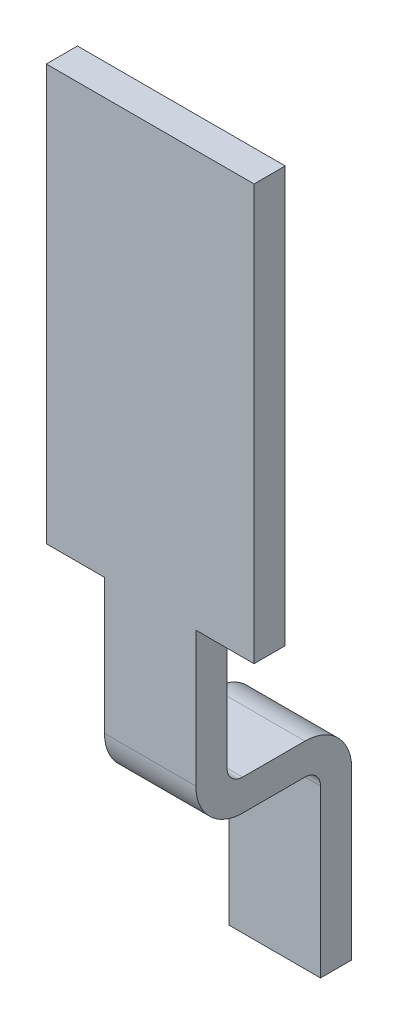
ISO-10303-21;
HEADER;
FILE_DESCRIPTION(('STEP AP214'),'2;1');
FILE_NAME('part.step','',(''),(''),'','','');
FILE_SCHEMA(('AUTOMOTIVE_DESIGN { 1 0 10303 214 1 1 1 1 }'));
ENDSEC;
DATA;
#1=APPLICATION_CONTEXT('core data for automotive mechanical design processes');
#2=APPLICATION_PROTOCOL_DEFINITION('international standard','automotive_design',2000,#1);
#3=PRODUCT_CONTEXT('',#1,'mechanical');
#4=PRODUCT('Part','Part','',(#3));
#5=PRODUCT_RELATED_PRODUCT_CATEGORY('part','',(#4));
#6=PRODUCT_DEFINITION_FORMATION('','',#4);
#7=PRODUCT_DEFINITION_CONTEXT('part definition',#1,'design');
#8=PRODUCT_DEFINITION('design','',#6,#7);
#9=PRODUCT_DEFINITION_SHAPE('','',#8);
#10=(LENGTH_UNIT() NAMED_UNIT(*) SI_UNIT(.MILLI.,.METRE.));
#11=(NAMED_UNIT(*) PLANE_ANGLE_UNIT() SI_UNIT($,.RADIAN.));
#12=(NAMED_UNIT(*) SI_UNIT($,.STERADIAN.) SOLID_ANGLE_UNIT());
#13=UNCERTAINTY_MEASURE_WITH_UNIT(LENGTH_MEASURE(1.E-05),#10,'distance_accuracy_value','');
#14=(GEOMETRIC_REPRESENTATION_CONTEXT(3) GLOBAL_UNCERTAINTY_ASSIGNED_CONTEXT((#13)) GLOBAL_UNIT_ASSIGNED_CONTEXT((#10,
#11,#12)) REPRESENTATION_CONTEXT('',''));
#15=CARTESIAN_POINT('',(0.,0.,0.));
#16=DIRECTION('',(0.,0.,1.));
#17=DIRECTION('',(1.,0.,0.));
#18=AXIS2_PLACEMENT_3D('',#15,#16,#17);
#19=CARTESIAN_POINT('',(0.,-2.9,-0.075));
#20=DIRECTION('',(1.,0.,0.));
#21=DIRECTION('',(0.,1.,0.));
#22=AXIS2_PLACEMENT_3D('',#19,#20,#21);
#23=CYLINDRICAL_SURFACE('',#22,0.075);
#24=CARTESIAN_POINT('',(0.22,-2.9,-0.075));
#25=DIRECTION('',(1.,0.,0.));
#26=DIRECTION('',(0.,1.,0.));
#27=AXIS2_PLACEMENT_3D('',#24,#25,#26);
#28=CIRCLE('',#27,0.075);
#29=CARTESIAN_POINT('',(0.22,-2.9,0.));
#30=VERTEX_POINT('',#29);
#31=CARTESIAN_POINT('',(0.22,-2.975,-0.075));
#32=VERTEX_POINT('',#31);
#33=EDGE_CURVE('E217',#30,#32,#28,.T.);
#34=ORIENTED_EDGE('',*,*,#33,.T.);
#35=DIRECTION('',(1.,0.,0.));
#36=VECTOR('',#35,1.);
#37=CARTESIAN_POINT('',(-0.22,-2.975,-0.075));
#38=LINE('',#37,#36);
#39=CARTESIAN_POINT('',(-0.22,-2.975,-0.075));
#40=VERTEX_POINT('',#39);
#41=EDGE_CURVE('E238',#40,#32,#38,.T.);
#42=ORIENTED_EDGE('',*,*,#41,.F.);
#43=CARTESIAN_POINT('',(-0.22,-2.9,-0.075));
#44=DIRECTION('',(1.,0.,0.));
#45=DIRECTION('',(0.,1.,0.));
#46=AXIS2_PLACEMENT_3D('',#43,#44,#45);
#47=CIRCLE('',#46,0.075);
#48=CARTESIAN_POINT('',(-0.22,-2.9,0.));
#49=VERTEX_POINT('',#48);
#50=EDGE_CURVE('E264',#40,#49,#47,.F.);
#51=ORIENTED_EDGE('',*,*,#50,.T.);
#52=DIRECTION('',(1.,0.,0.));
#53=VECTOR('',#52,1.);
#54=CARTESIAN_POINT('',(-0.5,-2.9,0.));
#55=LINE('',#54,#53);
#56=EDGE_CURVE('E212',#49,#30,#55,.T.);
#57=ORIENTED_EDGE('',*,*,#56,.T.);
#58=EDGE_LOOP('',(#34,#42,#51,#57));
#59=FACE_BOUND('',#58,.T.);
#60=ADVANCED_FACE('F17',(#59),#23,.F.);
#61=CARTESIAN_POINT('',(-0.22,-2.975,-0.375));
#62=DIRECTION('',(0.,1.,0.));
#63=DIRECTION('',(0.,0.,1.));
#64=AXIS2_PLACEMENT_3D('',#61,#62,#63);
#65=PLANE('',#64);
#66=DIRECTION('',(-1.,0.,0.));
#67=VECTOR('',#66,1.);
#68=CARTESIAN_POINT('',(0.,-2.975,-0.375));
#69=LINE('',#68,#67);
#70=CARTESIAN_POINT('',(-0.22,-2.975,-0.375));
#71=VERTEX_POINT('',#70);
#72=CARTESIAN_POINT('',(0.22,-2.975,-0.375));
#73=VERTEX_POINT('',#72);
#74=EDGE_CURVE('E235',#71,#73,#69,.F.);
#75=ORIENTED_EDGE('',*,*,#74,.F.);
#76=DIRECTION('',(0.,0.,-1.));
#77=VECTOR('',#76,1.);
#78=CARTESIAN_POINT('',(-0.22,-2.975,0.15));
#79=LINE('',#78,#77);
#80=EDGE_CURVE('E265',#71,#40,#79,.F.);
#81=ORIENTED_EDGE('',*,*,#80,.T.);
#82=ORIENTED_EDGE('',*,*,#41,.T.);
#83=DIRECTION('',(0.,0.,1.));
#84=VECTOR('',#83,1.);
#85=CARTESIAN_POINT('',(0.22,-2.975,0.15));
#86=LINE('',#85,#84);
#87=EDGE_CURVE('E259',#32,#73,#86,.F.);
#88=ORIENTED_EDGE('',*,*,#87,.T.);
#89=EDGE_LOOP('',(#75,#81,#82,#88));
#90=FACE_BOUND('',#89,.T.);
#91=ADVANCED_FACE('F351',(#90),#65,.T.);
#92=CARTESIAN_POINT('',(0.,-3.2,-0.375));
#93=DIRECTION('',(-1.,0.,0.));
#94=DIRECTION('',(0.,-1.,0.));
#95=AXIS2_PLACEMENT_3D('',#92,#93,#94);
#96=CYLINDRICAL_SURFACE('',#95,0.225);
#97=DIRECTION('',(1.,0.,0.));
#98=VECTOR('',#97,1.);
#99=CARTESIAN_POINT('',(-0.22,-3.2,-0.6));
#100=LINE('',#99,#98);
#101=CARTESIAN_POINT('',(-0.22,-3.2,-0.6));
#102=VERTEX_POINT('',#101);
#103=CARTESIAN_POINT('',(0.22,-3.2,-0.6));
#104=VERTEX_POINT('',#103);
#105=EDGE_CURVE('E230',#102,#104,#100,.T.);
#106=ORIENTED_EDGE('',*,*,#105,.F.);
#107=CARTESIAN_POINT('',(-0.22,-3.2,-0.375));
#108=DIRECTION('',(-1.,0.,0.));
#109=DIRECTION('',(0.,-1.,0.));
#110=AXIS2_PLACEMENT_3D('',#107,#108,#109);
#111=CIRCLE('',#110,0.225);
#112=EDGE_CURVE('E266',#102,#71,#111,.F.);
#113=ORIENTED_EDGE('',*,*,#112,.T.);
#114=ORIENTED_EDGE('',*,*,#74,.T.);
#115=CARTESIAN_POINT('',(0.22,-3.2,-0.375));
#116=DIRECTION('',(-1.,0.,0.));
#117=DIRECTION('',(0.,-1.,0.));
#118=AXIS2_PLACEMENT_3D('',#115,#116,#117);
#119=CIRCLE('',#118,0.225);
#120=EDGE_CURVE('E257',#73,#104,#119,.T.);
#121=ORIENTED_EDGE('',*,*,#120,.T.);
#122=EDGE_LOOP('',(#106,#113,#114,#121));
#123=FACE_BOUND('',#122,.T.);
#124=ADVANCED_FACE('F353',(#123),#96,.T.);
#125=CARTESIAN_POINT('',(-0.22,-4.,-0.6));
#126=DIRECTION('',(0.,0.,-1.));
#127=DIRECTION('',(0.,1.,0.));
#128=AXIS2_PLACEMENT_3D('',#125,#126,#127);
#129=PLANE('',#128);
#130=DIRECTION('',(1.,0.,0.));
#131=VECTOR('',#130,1.);
#132=CARTESIAN_POINT('',(0.,-4.,-0.6));
#133=LINE('',#132,#131);
#134=CARTESIAN_POINT('',(0.22,-4.,-0.6));
#135=VERTEX_POINT('',#134);
#136=CARTESIAN_POINT('',(-0.22,-4.,-0.6));
#137=VERTEX_POINT('',#136);
#138=EDGE_CURVE('E221',#135,#137,#133,.F.);
#139=ORIENTED_EDGE('',*,*,#138,.T.);
#140=DIRECTION('',(0.,1.,0.));
#141=VECTOR('',#140,1.);
#142=CARTESIAN_POINT('',(-0.22,-2.25,-0.6));
#143=LINE('',#142,#141);
#144=EDGE_CURVE('E155',#137,#102,#143,.T.);
#145=ORIENTED_EDGE('',*,*,#144,.T.);
#146=ORIENTED_EDGE('',*,*,#105,.T.);
#147=DIRECTION('',(0.,1.,0.));
#148=VECTOR('',#147,1.);
#149=CARTESIAN_POINT('',(0.22,-2.75,-0.6));
#150=LINE('',#149,#148);
#151=EDGE_CURVE('E226',#104,#135,#150,.F.);
#152=ORIENTED_EDGE('',*,*,#151,.T.);
#153=EDGE_LOOP('',(#139,#145,#146,#152));
#154=FACE_BOUND('',#153,.T.);
#155=ADVANCED_FACE('F357',(#154),#129,.T.);
#156=CARTESIAN_POINT('',(0.,-4.,-0.525));
#157=DIRECTION('',(0.,1.,0.));
#158=DIRECTION('',(0.,0.,1.));
#159=AXIS2_PLACEMENT_3D('',#156,#157,#158);
#160=PLANE('',#159);
#161=DIRECTION('',(0.,0.,1.));
#162=VECTOR('',#161,1.);
#163=CARTESIAN_POINT('',(0.22,-4.,0.15));
#164=LINE('',#163,#162);
#165=CARTESIAN_POINT('',(0.22,-4.,-0.45));
#166=VERTEX_POINT('',#165);
#167=EDGE_CURVE('E224',#135,#166,#164,.T.);
#168=ORIENTED_EDGE('',*,*,#167,.T.);
#169=DIRECTION('',(1.,0.,0.));
#170=VECTOR('',#169,1.);
#171=CARTESIAN_POINT('',(0.22,-4.,-0.45));
#172=LINE('',#171,#170);
#173=CARTESIAN_POINT('',(-0.22,-4.,-0.45));
#174=VERTEX_POINT('',#173);
#175=EDGE_CURVE('E143',#174,#166,#172,.T.);
#176=ORIENTED_EDGE('',*,*,#175,.F.);
#177=DIRECTION('',(0.,0.,-1.));
#178=VECTOR('',#177,1.);
#179=CARTESIAN_POINT('',(-0.22,-4.,0.15));
#180=LINE('',#179,#178);
#181=EDGE_CURVE('E153',#174,#137,#180,.T.);
#182=ORIENTED_EDGE('',*,*,#181,.T.);
#183=ORIENTED_EDGE('',*,*,#138,.F.);
#184=EDGE_LOOP('',(#168,#176,#182,#183));
#185=FACE_BOUND('',#184,.T.);
#186=ADVANCED_FACE('F359',(#185),#160,.F.);
#187=CARTESIAN_POINT('',(0.22,-4.,-0.45));
#188=DIRECTION('',(0.,0.,1.));
#189=DIRECTION('',(0.,-1.,0.));
#190=AXIS2_PLACEMENT_3D('',#187,#188,#189);
#191=PLANE('',#190);
#192=DIRECTION('',(0.,1.,0.));
#193=VECTOR('',#192,1.);
#194=CARTESIAN_POINT('',(-0.22,-2.25,-0.45));
#195=LINE('',#194,#193);
#196=CARTESIAN_POINT('',(-0.22,-3.2,-0.45));
#197=VERTEX_POINT('',#196);
#198=EDGE_CURVE('E138',#197,#174,#195,.F.);
#199=ORIENTED_EDGE('',*,*,#198,.T.);
#200=ORIENTED_EDGE('',*,*,#175,.T.);
#201=DIRECTION('',(0.,1.,0.));
#202=VECTOR('',#201,1.);
#203=CARTESIAN_POINT('',(0.22,-2.75,-0.45));
#204=LINE('',#203,#202);
#205=CARTESIAN_POINT('',(0.22,-3.2,-0.45));
#206=VERTEX_POINT('',#205);
#207=EDGE_CURVE('E141',#166,#206,#204,.T.);
#208=ORIENTED_EDGE('',*,*,#207,.T.);
#209=DIRECTION('',(-1.,0.,0.));
#210=VECTOR('',#209,1.);
#211=CARTESIAN_POINT('',(0.,-3.2,-0.45));
#212=LINE('',#211,#210);
#213=EDGE_CURVE('E134',#206,#197,#212,.T.);
#214=ORIENTED_EDGE('',*,*,#213,.T.);
#215=EDGE_LOOP('',(#199,#200,#208,#214));
#216=FACE_BOUND('',#215,.T.);
#217=ADVANCED_FACE('F135',(#216),#191,.T.);
#218=CARTESIAN_POINT('',(0.,-3.2,-0.375));
#219=DIRECTION('',(-1.,0.,0.));
#220=DIRECTION('',(0.,-1.,0.));
#221=AXIS2_PLACEMENT_3D('',#218,#219,#220);
#222=CYLINDRICAL_SURFACE('',#221,0.075);
#223=DIRECTION('',(1.,0.,0.));
#224=VECTOR('',#223,1.);
#225=CARTESIAN_POINT('',(0.22,-3.125,-0.375));
#226=LINE('',#225,#224);
#227=CARTESIAN_POINT('',(-0.22,-3.125,-0.375));
#228=VERTEX_POINT('',#227);
#229=CARTESIAN_POINT('',(0.22,-3.125,-0.375));
#230=VERTEX_POINT('',#229);
#231=EDGE_CURVE('E128',#228,#230,#226,.T.);
#232=ORIENTED_EDGE('',*,*,#231,.F.);
#233=CARTESIAN_POINT('',(-0.22,-3.2,-0.375));
#234=DIRECTION('',(-1.,0.,0.));
#235=DIRECTION('',(0.,-1.,0.));
#236=AXIS2_PLACEMENT_3D('',#233,#234,#235);
#237=CIRCLE('',#236,0.075);
#238=EDGE_CURVE('E20',#228,#197,#237,.T.);
#239=ORIENTED_EDGE('',*,*,#238,.T.);
#240=ORIENTED_EDGE('',*,*,#213,.F.);
#241=CARTESIAN_POINT('',(0.22,-3.2,-0.375));
#242=DIRECTION('',(-1.,0.,0.));
#243=DIRECTION('',(0.,-1.,0.));
#244=AXIS2_PLACEMENT_3D('',#241,#242,#243);
#245=CIRCLE('',#244,0.075);
#246=EDGE_CURVE('E255',#206,#230,#245,.F.);
#247=ORIENTED_EDGE('',*,*,#246,.T.);
#248=EDGE_LOOP('',(#232,#239,#240,#247));
#249=FACE_BOUND('',#248,.T.);
#250=ADVANCED_FACE('F146',(#249),#222,.F.);
#251=CARTESIAN_POINT('',(0.22,-3.125,-0.375));
#252=DIRECTION('',(0.,-1.,0.));
#253=DIRECTION('',(0.,0.,-1.));
#254=AXIS2_PLACEMENT_3D('',#251,#252,#253);
#255=PLANE('',#254);
#256=DIRECTION('',(0.,0.,-1.));
#257=VECTOR('',#256,1.);
#258=CARTESIAN_POINT('',(-0.22,-3.125,0.15));
#259=LINE('',#258,#257);
#260=CARTESIAN_POINT('',(-0.22,-3.125,-0.075));
#261=VERTEX_POINT('',#260);
#262=EDGE_CURVE('E148',#261,#228,#259,.T.);
#263=ORIENTED_EDGE('',*,*,#262,.T.);
#264=ORIENTED_EDGE('',*,*,#231,.T.);
#265=DIRECTION('',(0.,0.,1.));
#266=VECTOR('',#265,1.);
#267=CARTESIAN_POINT('',(0.22,-3.125,0.15));
#268=LINE('',#267,#266);
#269=CARTESIAN_POINT('',(0.22,-3.125,-0.075));
#270=VERTEX_POINT('',#269);
#271=EDGE_CURVE('E254',#230,#270,#268,.T.);
#272=ORIENTED_EDGE('',*,*,#271,.T.);
#273=DIRECTION('',(1.,0.,0.));
#274=VECTOR('',#273,1.);
#275=CARTESIAN_POINT('',(0.,-3.125,-0.075));
#276=LINE('',#275,#274);
#277=EDGE_CURVE('E214',#261,#270,#276,.T.);
#278=ORIENTED_EDGE('',*,*,#277,.F.);
#279=EDGE_LOOP('',(#263,#264,#272,#278));
#280=FACE_BOUND('',#279,.T.);
#281=ADVANCED_FACE('F361',(#280),#255,.T.);
#282=CARTESIAN_POINT('',(-0.5,-2.25,0.));
#283=DIRECTION('',(0.,0.,1.));
#284=DIRECTION('',(1.,0.,0.));
#285=AXIS2_PLACEMENT_3D('',#282,#283,#284);
#286=PLANE('',#285);
#287=DIRECTION('',(1.,0.,0.));
#288=VECTOR('',#287,1.);
#289=CARTESIAN_POINT('',(-0.5,-0.25,0.));
#290=LINE('',#289,#288);
#291=CARTESIAN_POINT('',(0.5,-0.25,0.));
#292=VERTEX_POINT('',#291);
#293=CARTESIAN_POINT('',(-0.5,-0.25,0.));
#294=VERTEX_POINT('',#293);
#295=EDGE_CURVE('E194',#292,#294,#290,.F.);
#296=ORIENTED_EDGE('',*,*,#295,.F.);
#297=DIRECTION('',(0.,1.,0.));
#298=VECTOR('',#297,1.);
#299=CARTESIAN_POINT('',(0.5,-2.25,0.));
#300=LINE('',#299,#298);
#301=CARTESIAN_POINT('',(0.5,-2.25,0.));
#302=VERTEX_POINT('',#301);
#303=EDGE_CURVE('E203',#292,#302,#300,.F.);
#304=ORIENTED_EDGE('',*,*,#303,.T.);
#305=DIRECTION('',(1.,0.,0.));
#306=VECTOR('',#305,1.);
#307=CARTESIAN_POINT('',(-0.5,-2.25,0.));
#308=LINE('',#307,#306);
#309=CARTESIAN_POINT('',(0.22,-2.25,0.));
#310=VERTEX_POINT('',#309);
#311=EDGE_CURVE('E197',#302,#310,#308,.F.);
#312=ORIENTED_EDGE('',*,*,#311,.T.);
#313=DIRECTION('',(0.,1.,0.));
#314=VECTOR('',#313,1.);
#315=CARTESIAN_POINT('',(0.22,-2.75,0.));
#316=LINE('',#315,#314);
#317=EDGE_CURVE('E200',#310,#30,#316,.F.);
#318=ORIENTED_EDGE('',*,*,#317,.T.);
#319=ORIENTED_EDGE('',*,*,#56,.F.);
#320=DIRECTION('',(0.,1.,0.));
#321=VECTOR('',#320,1.);
#322=CARTESIAN_POINT('',(-0.22,-2.25,0.));
#323=LINE('',#322,#321);
#324=CARTESIAN_POINT('',(-0.22,-2.25,0.));
#325=VERTEX_POINT('',#324);
#326=EDGE_CURVE('E263',#49,#325,#323,.T.);
#327=ORIENTED_EDGE('',*,*,#326,.T.);
#328=DIRECTION('',(1.,0.,0.));
#329=VECTOR('',#328,1.);
#330=CARTESIAN_POINT('',(-0.5,-2.25,0.));
#331=LINE('',#330,#329);
#332=CARTESIAN_POINT('',(-0.5,-2.25,0.));
#333=VERTEX_POINT('',#332);
#334=EDGE_CURVE('E177',#325,#333,#331,.F.);
#335=ORIENTED_EDGE('',*,*,#334,.T.);
#336=DIRECTION('',(0.,1.,0.));
#337=VECTOR('',#336,1.);
#338=CARTESIAN_POINT('',(-0.5,-0.25,0.));
#339=LINE('',#338,#337);
#340=EDGE_CURVE('E191',#333,#294,#339,.T.);
#341=ORIENTED_EDGE('',*,*,#340,.T.);
#342=EDGE_LOOP('',(#296,#304,#312,#318,#319,#327,#335,#341));
#343=FACE_BOUND('',#342,.T.);
#344=ADVANCED_FACE('F323',(#343),#286,.F.);
#345=CARTESIAN_POINT('',(-0.5,-0.25,0.15));
#346=DIRECTION('',(1.,0.,0.));
#347=DIRECTION('',(0.,0.,-1.));
#348=AXIS2_PLACEMENT_3D('',#345,#346,#347);
#349=PLANE('',#348);
#350=DIRECTION('',(0.,0.,1.));
#351=VECTOR('',#350,1.);
#352=CARTESIAN_POINT('',(-0.5,-2.25,0.15));
#353=LINE('',#352,#351);
#354=CARTESIAN_POINT('',(-0.5,-2.25,0.15));
#355=VERTEX_POINT('',#354);
#356=EDGE_CURVE('E166',#333,#355,#353,.T.);
#357=ORIENTED_EDGE('',*,*,#356,.T.);
#358=DIRECTION('',(0.,1.,0.));
#359=VECTOR('',#358,1.);
#360=CARTESIAN_POINT('',(-0.5,-2.25,0.15));
#361=LINE('',#360,#359);
#362=CARTESIAN_POINT('',(-0.5,-0.25,0.15));
#363=VERTEX_POINT('',#362);
#364=EDGE_CURVE('E173',#363,#355,#361,.F.);
#365=ORIENTED_EDGE('',*,*,#364,.F.);
#366=DIRECTION('',(0.,0.,-1.));
#367=VECTOR('',#366,1.);
#368=CARTESIAN_POINT('',(-0.5,-0.25,0.15));
#369=LINE('',#368,#367);
#370=EDGE_CURVE('E182',#363,#294,#369,.T.);
#371=ORIENTED_EDGE('',*,*,#370,.T.);
#372=ORIENTED_EDGE('',*,*,#340,.F.);
#373=EDGE_LOOP('',(#357,#365,#371,#372));
#374=FACE_BOUND('',#373,.T.);
#375=ADVANCED_FACE('F329',(#374),#349,.F.);
#376=CARTESIAN_POINT('',(-0.5,-2.25,0.15));
#377=DIRECTION('',(0.,1.,0.));
#378=DIRECTION('',(0.,0.,1.));
#379=AXIS2_PLACEMENT_3D('',#376,#377,#378);
#380=PLANE('',#379);
#381=DIRECTION('',(1.,0.,0.));
#382=VECTOR('',#381,1.);
#383=CARTESIAN_POINT('',(-0.5,-2.25,0.15));
#384=LINE('',#383,#382);
#385=CARTESIAN_POINT('',(-0.22,-2.25,0.15));
#386=VERTEX_POINT('',#385);
#387=EDGE_CURVE('E169',#355,#386,#384,.T.);
#388=ORIENTED_EDGE('',*,*,#387,.F.);
#389=ORIENTED_EDGE('',*,*,#356,.F.);
#390=ORIENTED_EDGE('',*,*,#334,.F.);
#391=DIRECTION('',(0.,0.,-1.));
#392=VECTOR('',#391,1.);
#393=CARTESIAN_POINT('',(-0.22,-2.25,0.15));
#394=LINE('',#393,#392);
#395=EDGE_CURVE('E164',#325,#386,#394,.F.);
#396=ORIENTED_EDGE('',*,*,#395,.T.);
#397=EDGE_LOOP('',(#388,#389,#390,#396));
#398=FACE_BOUND('',#397,.T.);
#399=ADVANCED_FACE('F334',(#398),#380,.F.);
#400=CARTESIAN_POINT('',(-0.22,-2.25,0.15));
#401=DIRECTION('',(1.,0.,0.));
#402=DIRECTION('',(0.,0.,-1.));
#403=AXIS2_PLACEMENT_3D('',#400,#401,#402);
#404=PLANE('',#403);
#405=ORIENTED_EDGE('',*,*,#50,.F.);
#406=ORIENTED_EDGE('',*,*,#80,.F.);
#407=ORIENTED_EDGE('',*,*,#112,.F.);
#408=ORIENTED_EDGE('',*,*,#144,.F.);
#409=ORIENTED_EDGE('',*,*,#181,.F.);
#410=ORIENTED_EDGE('',*,*,#198,.F.);
#411=ORIENTED_EDGE('',*,*,#238,.F.);
#412=ORIENTED_EDGE('',*,*,#262,.F.);
#413=CARTESIAN_POINT('',(-0.22,-2.9,-0.075));
#414=DIRECTION('',(1.,0.,0.));
#415=DIRECTION('',(0.,1.,0.));
#416=AXIS2_PLACEMENT_3D('',#413,#414,#415);
#417=CIRCLE('',#416,0.225);
#418=CARTESIAN_POINT('',(-0.22,-2.9,0.15));
#419=VERTEX_POINT('',#418);
#420=EDGE_CURVE('E218',#419,#261,#417,.T.);
#421=ORIENTED_EDGE('',*,*,#420,.F.);
#422=DIRECTION('',(0.,1.,0.));
#423=VECTOR('',#422,1.);
#424=CARTESIAN_POINT('',(-0.22,-2.25,0.15));
#425=LINE('',#424,#423);
#426=EDGE_CURVE('E172',#386,#419,#425,.F.);
#427=ORIENTED_EDGE('',*,*,#426,.F.);
#428=ORIENTED_EDGE('',*,*,#395,.F.);
#429=ORIENTED_EDGE('',*,*,#326,.F.);
#430=EDGE_LOOP('',(#405,#406,#407,#408,#409,#410,#411,#412,#421,#427,#428,#429));
#431=FACE_BOUND('',#430,.T.);
#432=ADVANCED_FACE('F150',(#431),#404,.F.);
#433=CARTESIAN_POINT('',(0.,-2.9,-0.075));
#434=DIRECTION('',(1.,0.,0.));
#435=DIRECTION('',(0.,1.,0.));
#436=AXIS2_PLACEMENT_3D('',#433,#434,#435);
#437=CYLINDRICAL_SURFACE('',#436,0.225);
#438=ORIENTED_EDGE('',*,*,#420,.T.);
#439=ORIENTED_EDGE('',*,*,#277,.T.);
#440=CARTESIAN_POINT('',(0.22,-2.9,-0.075));
#441=DIRECTION('',(1.,0.,0.));
#442=DIRECTION('',(0.,1.,0.));
#443=AXIS2_PLACEMENT_3D('',#440,#441,#442);
#444=CIRCLE('',#443,0.225);
#445=CARTESIAN_POINT('',(0.22,-2.9,0.15));
#446=VERTEX_POINT('',#445);
#447=EDGE_CURVE('E252',#270,#446,#444,.F.);
#448=ORIENTED_EDGE('',*,*,#447,.T.);
#449=DIRECTION('',(1.,0.,0.));
#450=VECTOR('',#449,1.);
#451=CARTESIAN_POINT('',(-0.5,-2.9,0.15));
#452=LINE('',#451,#450);
#453=EDGE_CURVE('E284',#419,#446,#452,.T.);
#454=ORIENTED_EDGE('',*,*,#453,.F.);
#455=EDGE_LOOP('',(#438,#439,#448,#454));
#456=FACE_BOUND('',#455,.T.);
#457=ADVANCED_FACE('F340',(#456),#437,.T.);
#458=CARTESIAN_POINT('',(0.22,-2.75,0.15));
#459=DIRECTION('',(-1.,0.,0.));
#460=DIRECTION('',(0.,0.,1.));
#461=AXIS2_PLACEMENT_3D('',#458,#459,#460);
#462=PLANE('',#461);
#463=DIRECTION('',(0.,0.,1.));
#464=VECTOR('',#463,1.);
#465=CARTESIAN_POINT('',(0.22,-2.25,0.15));
#466=LINE('',#465,#464);
#467=CARTESIAN_POINT('',(0.22,-2.25,0.15));
#468=VERTEX_POINT('',#467);
#469=EDGE_CURVE('E199',#310,#468,#466,.T.);
#470=ORIENTED_EDGE('',*,*,#469,.T.);
#471=DIRECTION('',(0.,1.,0.));
#472=VECTOR('',#471,1.);
#473=CARTESIAN_POINT('',(0.22,-2.25,0.15));
#474=LINE('',#473,#472);
#475=EDGE_CURVE('E293',#446,#468,#474,.T.);
#476=ORIENTED_EDGE('',*,*,#475,.F.);
#477=ORIENTED_EDGE('',*,*,#447,.F.);
#478=ORIENTED_EDGE('',*,*,#271,.F.);
#479=ORIENTED_EDGE('',*,*,#246,.F.);
#480=ORIENTED_EDGE('',*,*,#207,.F.);
#481=ORIENTED_EDGE('',*,*,#167,.F.);
#482=ORIENTED_EDGE('',*,*,#151,.F.);
#483=ORIENTED_EDGE('',*,*,#120,.F.);
#484=ORIENTED_EDGE('',*,*,#87,.F.);
#485=ORIENTED_EDGE('',*,*,#33,.F.);
#486=ORIENTED_EDGE('',*,*,#317,.F.);
#487=EDGE_LOOP('',(#470,#476,#477,#478,#479,#480,#481,#482,#483,#484,#485,#486));
#488=FACE_BOUND('',#487,.T.);
#489=ADVANCED_FACE('F344',(#488),#462,.F.);
#490=CARTESIAN_POINT('',(-0.5,-2.25,0.15));
#491=DIRECTION('',(0.,1.,0.));
#492=DIRECTION('',(0.,0.,1.));
#493=AXIS2_PLACEMENT_3D('',#490,#491,#492);
#494=PLANE('',#493);
#495=ORIENTED_EDGE('',*,*,#469,.F.);
#496=ORIENTED_EDGE('',*,*,#311,.F.);
#497=DIRECTION('',(0.,0.,1.));
#498=VECTOR('',#497,1.);
#499=CARTESIAN_POINT('',(0.5,-2.25,0.15));
#500=LINE('',#499,#498);
#501=CARTESIAN_POINT('',(0.5,-2.25,0.15));
#502=VERTEX_POINT('',#501);
#503=EDGE_CURVE('E206',#302,#502,#500,.T.);
#504=ORIENTED_EDGE('',*,*,#503,.T.);
#505=DIRECTION('',(1.,0.,0.));
#506=VECTOR('',#505,1.);
#507=CARTESIAN_POINT('',(-0.5,-2.25,0.15));
#508=LINE('',#507,#506);
#509=EDGE_CURVE('E290',#468,#502,#508,.T.);
#510=ORIENTED_EDGE('',*,*,#509,.F.);
#511=EDGE_LOOP('',(#495,#496,#504,#510));
#512=FACE_BOUND('',#511,.T.);
#513=ADVANCED_FACE('F320',(#512),#494,.F.);
#514=CARTESIAN_POINT('',(0.5,-2.25,0.15));
#515=DIRECTION('',(-1.,0.,0.));
#516=DIRECTION('',(0.,0.,1.));
#517=AXIS2_PLACEMENT_3D('',#514,#515,#516);
#518=PLANE('',#517);
#519=DIRECTION('',(0.,0.,-1.));
#520=VECTOR('',#519,1.);
#521=CARTESIAN_POINT('',(0.5,-0.25,0.15));
#522=LINE('',#521,#520);
#523=CARTESIAN_POINT('',(0.5,-0.25,0.15));
#524=VERTEX_POINT('',#523);
#525=EDGE_CURVE('E35',#292,#524,#522,.F.);
#526=ORIENTED_EDGE('',*,*,#525,.T.);
#527=DIRECTION('',(0.,1.,0.));
#528=VECTOR('',#527,1.);
#529=CARTESIAN_POINT('',(0.5,-2.25,0.15));
#530=LINE('',#529,#528);
#531=EDGE_CURVE('E26',#502,#524,#530,.T.);
#532=ORIENTED_EDGE('',*,*,#531,.F.);
#533=ORIENTED_EDGE('',*,*,#503,.F.);
#534=ORIENTED_EDGE('',*,*,#303,.F.);
#535=EDGE_LOOP('',(#526,#532,#533,#534));
#536=FACE_BOUND('',#535,.T.);
#537=ADVANCED_FACE('F317',(#536),#518,.F.);
#538=CARTESIAN_POINT('',(0.5,-0.25,0.15));
#539=DIRECTION('',(0.,-1.,0.));
#540=DIRECTION('',(0.,0.,-1.));
#541=AXIS2_PLACEMENT_3D('',#538,#539,#540);
#542=PLANE('',#541);
#543=ORIENTED_EDGE('',*,*,#370,.F.);
#544=DIRECTION('',(1.,0.,0.));
#545=VECTOR('',#544,1.);
#546=CARTESIAN_POINT('',(-0.5,-0.25,0.15));
#547=LINE('',#546,#545);
#548=EDGE_CURVE('E11',#524,#363,#547,.F.);
#549=ORIENTED_EDGE('',*,*,#548,.F.);
#550=ORIENTED_EDGE('',*,*,#525,.F.);
#551=ORIENTED_EDGE('',*,*,#295,.T.);
#552=EDGE_LOOP('',(#543,#549,#550,#551));
#553=FACE_BOUND('',#552,.T.);
#554=ADVANCED_FACE('F327',(#553),#542,.F.);
#555=CARTESIAN_POINT('',(-0.5,-2.25,0.15));
#556=DIRECTION('',(0.,0.,1.));
#557=DIRECTION('',(1.,0.,0.));
#558=AXIS2_PLACEMENT_3D('',#555,#556,#557);
#559=PLANE('',#558);
#560=ORIENTED_EDGE('',*,*,#531,.T.);
#561=ORIENTED_EDGE('',*,*,#548,.T.);
#562=ORIENTED_EDGE('',*,*,#364,.T.);
#563=ORIENTED_EDGE('',*,*,#387,.T.);
#564=ORIENTED_EDGE('',*,*,#426,.T.);
#565=ORIENTED_EDGE('',*,*,#453,.T.);
#566=ORIENTED_EDGE('',*,*,#475,.T.);
#567=ORIENTED_EDGE('',*,*,#509,.T.);
#568=EDGE_LOOP('',(#560,#561,#562,#563,#564,#565,#566,#567));
#569=FACE_BOUND('',#568,.T.);
#570=ADVANCED_FACE('F314',(#569),#559,.T.);
#571=CLOSED_SHELL('',(#60,#91,#124,#155,#186,#217,#250,#281,#344,#375,#399,#432,#457,#489,#513,
#537,#554,#570));
#572=MANIFOLD_SOLID_BREP('B1',#571);
#573=ADVANCED_BREP_SHAPE_REPRESENTATION('',(#18,#572),#14);
#574=SHAPE_DEFINITION_REPRESENTATION(#9,#573);
ENDSEC;
END-ISO-10303-21;
